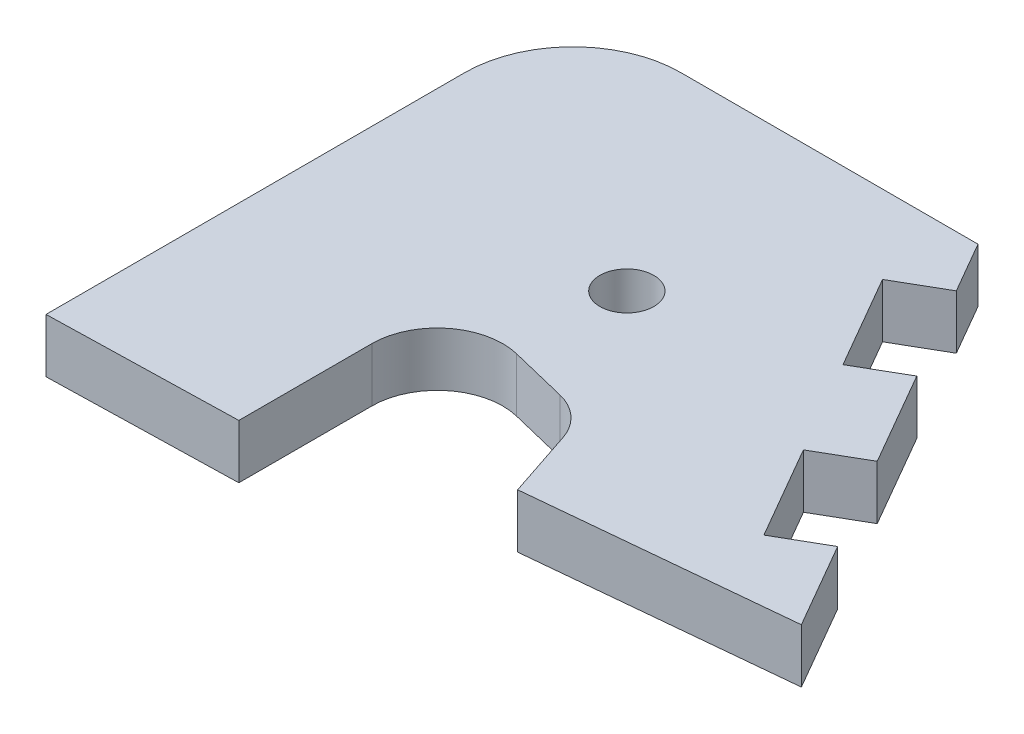
ISO-10303-21;
HEADER;
FILE_DESCRIPTION(('STEP AP214'),'2;1');
FILE_NAME('part.step','',(''),(''),'','','');
FILE_SCHEMA(('AUTOMOTIVE_DESIGN { 1 0 10303 214 1 1 1 1 }'));
ENDSEC;
DATA;
#1=APPLICATION_CONTEXT('core data for automotive mechanical design processes');
#2=APPLICATION_PROTOCOL_DEFINITION('international standard','automotive_design',2000,#1);
#3=PRODUCT_CONTEXT('',#1,'mechanical');
#4=PRODUCT('Part','Part','',(#3));
#5=PRODUCT_RELATED_PRODUCT_CATEGORY('part','',(#4));
#6=PRODUCT_DEFINITION_FORMATION('','',#4);
#7=PRODUCT_DEFINITION_CONTEXT('part definition',#1,'design');
#8=PRODUCT_DEFINITION('design','',#6,#7);
#9=PRODUCT_DEFINITION_SHAPE('','',#8);
#10=(LENGTH_UNIT() NAMED_UNIT(*) SI_UNIT(.MILLI.,.METRE.));
#11=(NAMED_UNIT(*) PLANE_ANGLE_UNIT() SI_UNIT($,.RADIAN.));
#12=(NAMED_UNIT(*) SI_UNIT($,.STERADIAN.) SOLID_ANGLE_UNIT());
#13=UNCERTAINTY_MEASURE_WITH_UNIT(LENGTH_MEASURE(1.E-05),#10,'distance_accuracy_value','');
#14=(GEOMETRIC_REPRESENTATION_CONTEXT(3) GLOBAL_UNCERTAINTY_ASSIGNED_CONTEXT((#13)) GLOBAL_UNIT_ASSIGNED_CONTEXT((#10,
#11,#12)) REPRESENTATION_CONTEXT('',''));
#15=CARTESIAN_POINT('',(0.,0.,0.));
#16=DIRECTION('',(0.,0.,1.));
#17=DIRECTION('',(1.,0.,0.));
#18=AXIS2_PLACEMENT_3D('',#15,#16,#17);
#19=CARTESIAN_POINT('',(8.10437226417191,10.,32.5780480350778));
#20=DIRECTION('',(0.,-1.,0.));
#21=DIRECTION('',(0.,0.,-1.));
#22=AXIS2_PLACEMENT_3D('',#19,#20,#21);
#23=PLANE('',#22);
#24=DIRECTION('',(-0.499999999999998,0.,-0.86602540378444));
#25=VECTOR('',#24,1.);
#26=CARTESIAN_POINT('',(25.,10.,-40.));
#27=LINE('',#26,#25);
#28=CARTESIAN_POINT('',(30.4788257655355,10.,-30.510395408275));
#29=VERTEX_POINT('',#28);
#30=CARTESIAN_POINT('',(25.,10.,-40.));
#31=VERTEX_POINT('',#30);
#32=EDGE_CURVE('E206',#29,#31,#27,.T.);
#33=ORIENTED_EDGE('',*,*,#32,.T.);
#34=DIRECTION('',(1.,0.,0.));
#35=VECTOR('',#34,1.);
#36=CARTESIAN_POINT('',(-50.,10.,-40.));
#37=LINE('',#36,#35);
#38=CARTESIAN_POINT('',(-30.,10.,-40.));
#39=VERTEX_POINT('',#38);
#40=EDGE_CURVE('E86',#31,#39,#37,.F.);
#41=ORIENTED_EDGE('',*,*,#40,.T.);
#42=CARTESIAN_POINT('',(-30.,10.,-20.));
#43=DIRECTION('',(0.,-1.,0.));
#44=DIRECTION('',(0.,0.,-1.));
#45=AXIS2_PLACEMENT_3D('',#42,#43,#44);
#46=CIRCLE('',#45,20.);
#47=CARTESIAN_POINT('',(-50.,10.,-20.));
#48=VERTEX_POINT('',#47);
#49=EDGE_CURVE('E78',#48,#39,#46,.T.);
#50=ORIENTED_EDGE('',*,*,#49,.F.);
#51=DIRECTION('',(0.,0.,-1.));
#52=VECTOR('',#51,1.);
#53=CARTESIAN_POINT('',(-50.,10.,13.));
#54=LINE('',#53,#52);
#55=CARTESIAN_POINT('',(-50.,10.,57.5173994804494));
#56=VERTEX_POINT('',#55);
#57=EDGE_CURVE('E146',#48,#56,#54,.F.);
#58=ORIENTED_EDGE('',*,*,#57,.T.);
#59=DIRECTION('',(0.999701273568704,0.,-0.0244410234055541));
#60=VECTOR('',#59,1.);
#61=CARTESIAN_POINT('',(-15.1570472119715,10.,56.6655475851619));
#62=LINE('',#61,#60);
#63=CARTESIAN_POINT('',(-15.1570472119715,10.,56.6655475851619));
#64=VERTEX_POINT('',#63);
#65=EDGE_CURVE('E237',#56,#64,#62,.T.);
#66=ORIENTED_EDGE('',*,*,#65,.T.);
#67=DIRECTION('',(0.,0.,-1.));
#68=VECTOR('',#67,1.);
#69=CARTESIAN_POINT('',(-15.1570472119715,10.,32.0421540849214));
#70=LINE('',#69,#68);
#71=CARTESIAN_POINT('',(-15.1570472119715,10.,32.0421540849214));
#72=VERTEX_POINT('',#71);
#73=EDGE_CURVE('E334',#64,#72,#70,.T.);
#74=ORIENTED_EDGE('',*,*,#73,.T.);
#75=CARTESIAN_POINT('',(-3.03936223927807,10.,32.0421540849214));
#76=DIRECTION('',(0.,-1.,0.));
#77=DIRECTION('',(0.,0.,1.));
#78=AXIS2_PLACEMENT_3D('',#75,#76,#77);
#79=CIRCLE('',#78,12.1176849726935);
#80=CARTESIAN_POINT('',(-0.17043084930761,10.,20.2689845126659));
#81=VERTEX_POINT('',#80);
#82=EDGE_CURVE('E336',#72,#81,#79,.T.);
#83=ORIENTED_EDGE('',*,*,#82,.T.);
#84=DIRECTION('',(-0.971569206394266,0.,-0.236755733164829));
#85=VECTOR('',#84,1.);
#86=CARTESIAN_POINT('',(-29.9999999999998,10.,13.));
#87=LINE('',#86,#85);
#88=CARTESIAN_POINT('',(10.4719295958201,10.,22.8623559711353));
#89=VERTEX_POINT('',#88);
#90=EDGE_CURVE('E38',#81,#89,#87,.F.);
#91=ORIENTED_EDGE('',*,*,#90,.T.);
#92=CARTESIAN_POINT('',(8.10437226417191,10.,32.5780480350778));
#93=DIRECTION('',(0.,-1.,0.));
#94=DIRECTION('',(0.,0.,-1.));
#95=AXIS2_PLACEMENT_3D('',#92,#93,#94);
#96=CIRCLE('',#95,9.99999999999988);
#97=CARTESIAN_POINT('',(17.5939768558969,10.,29.4240973866512));
#98=VERTEX_POINT('',#97);
#99=EDGE_CURVE('E297',#89,#98,#96,.T.);
#100=ORIENTED_EDGE('',*,*,#99,.T.);
#101=DIRECTION('',(-0.315395064842665,0.,-0.948960459172505));
#102=VECTOR('',#101,1.);
#103=CARTESIAN_POINT('',(17.5939768558969,10.,29.4240973866513));
#104=LINE('',#103,#102);
#105=CARTESIAN_POINT('',(21.7669081574552,10.,41.9796102828265));
#106=VERTEX_POINT('',#105);
#107=EDGE_CURVE('E300',#98,#106,#104,.F.);
#108=ORIENTED_EDGE('',*,*,#107,.T.);
#109=DIRECTION('',(0.995364514557602,0.,-0.0961742333450592));
#110=VECTOR('',#109,1.);
#111=CARTESIAN_POINT('',(21.7669081574552,10.,41.9796102828265));
#112=LINE('',#111,#110);
#113=CARTESIAN_POINT('',(69.6592830691413,10.,37.3521473053536));
#114=VERTEX_POINT('',#113);
#115=EDGE_CURVE('E340',#106,#114,#112,.T.);
#116=ORIENTED_EDGE('',*,*,#115,.T.);
#117=DIRECTION('',(-0.499999999999998,0.,-0.86602540378444));
#118=VECTOR('',#117,1.);
#119=CARTESIAN_POINT('',(60.4788257655354,10.,21.4511288187914));
#120=LINE('',#119,#118);
#121=CARTESIAN_POINT('',(60.4788257655354,10.,21.4511288187914));
#122=VERTEX_POINT('',#121);
#123=EDGE_CURVE('E342',#114,#122,#120,.T.);
#124=ORIENTED_EDGE('',*,*,#123,.T.);
#125=DIRECTION('',(-0.866025403784439,0.,0.499999999999999));
#126=VECTOR('',#125,1.);
#127=CARTESIAN_POINT('',(60.4788257655354,10.,21.4511288187914));
#128=LINE('',#127,#126);
#129=CARTESIAN_POINT('',(51.8185717276911,10.,26.4511288187914));
#130=VERTEX_POINT('',#129);
#131=EDGE_CURVE('E344',#122,#130,#128,.T.);
#132=ORIENTED_EDGE('',*,*,#131,.T.);
#133=DIRECTION('',(-0.499999999999999,0.,-0.866025403784439));
#134=VECTOR('',#133,1.);
#135=CARTESIAN_POINT('',(41.8185717276911,10.,9.13062074310259));
#136=LINE('',#135,#134);
#137=CARTESIAN_POINT('',(41.8185717276911,10.,9.13062074310259));
#138=VERTEX_POINT('',#137);
#139=EDGE_CURVE('E346',#130,#138,#136,.T.);
#140=ORIENTED_EDGE('',*,*,#139,.T.);
#141=DIRECTION('',(0.866025403784439,0.,-0.499999999999999));
#142=VECTOR('',#141,1.);
#143=CARTESIAN_POINT('',(50.4788257655355,10.,4.13062074310261));
#144=LINE('',#143,#142);
#145=CARTESIAN_POINT('',(50.4788257655355,10.,4.13062074310261));
#146=VERTEX_POINT('',#145);
#147=EDGE_CURVE('E348',#138,#146,#144,.T.);
#148=ORIENTED_EDGE('',*,*,#147,.T.);
#149=DIRECTION('',(-0.499999999999998,0.,-0.86602540378444));
#150=VECTOR('',#149,1.);
#151=CARTESIAN_POINT('',(40.4788257655355,10.,-13.1898873325862));
#152=LINE('',#151,#150);
#153=CARTESIAN_POINT('',(40.4788257655355,10.,-13.1898873325862));
#154=VERTEX_POINT('',#153);
#155=EDGE_CURVE('E350',#146,#154,#152,.T.);
#156=ORIENTED_EDGE('',*,*,#155,.T.);
#157=DIRECTION('',(-0.866025403784439,0.,0.499999999999999));
#158=VECTOR('',#157,1.);
#159=CARTESIAN_POINT('',(40.4788257655355,10.,-13.1898873325862));
#160=LINE('',#159,#158);
#161=CARTESIAN_POINT('',(31.8185717276911,10.,-8.1898873325862));
#162=VERTEX_POINT('',#161);
#163=EDGE_CURVE('E188',#154,#162,#160,.T.);
#164=ORIENTED_EDGE('',*,*,#163,.T.);
#165=DIRECTION('',(-0.499999999999998,0.,-0.86602540378444));
#166=VECTOR('',#165,1.);
#167=CARTESIAN_POINT('',(21.8185717276911,10.,-25.510395408275));
#168=LINE('',#167,#166);
#169=CARTESIAN_POINT('',(21.8185717276911,10.,-25.510395408275));
#170=VERTEX_POINT('',#169);
#171=EDGE_CURVE('E181',#162,#170,#168,.T.);
#172=ORIENTED_EDGE('',*,*,#171,.T.);
#173=DIRECTION('',(0.86602540378444,0.,-0.499999999999998));
#174=VECTOR('',#173,1.);
#175=CARTESIAN_POINT('',(30.4788257655355,10.,-30.510395408275));
#176=LINE('',#175,#174);
#177=EDGE_CURVE('E185',#170,#29,#176,.T.);
#178=ORIENTED_EDGE('',*,*,#177,.T.);
#179=EDGE_LOOP('',(#33,#41,#50,#58,#66,#74,#83,#91,#100,#108,#116,#124,#132,#140,#148,#156,#164,
#172,#178));
#180=FACE_BOUND('',#179,.T.);
#181=CARTESIAN_POINT('',(0.,10.,0.));
#182=DIRECTION('',(0.,-1.,0.));
#183=DIRECTION('',(0.,0.,-1.));
#184=AXIS2_PLACEMENT_3D('',#181,#182,#183);
#185=CIRCLE('',#184,5.);
#186=CARTESIAN_POINT('',(0.,10.,-5.));
#187=VERTEX_POINT('',#186);
#188=EDGE_CURVE('E291',#187,#187,#185,.T.);
#189=ORIENTED_EDGE('',*,*,#188,.T.);
#190=EDGE_LOOP('',(#189));
#191=FACE_BOUND('',#190,.T.);
#192=ADVANCED_FACE('F35',(#180,#191),#23,.F.);
#193=CARTESIAN_POINT('',(-50.,10.,13.));
#194=DIRECTION('',(1.,0.,0.));
#195=DIRECTION('',(0.,0.,-1.));
#196=AXIS2_PLACEMENT_3D('',#193,#194,#195);
#197=PLANE('',#196);
#198=DIRECTION('',(0.,-1.,0.));
#199=VECTOR('',#198,1.);
#200=CARTESIAN_POINT('',(-50.,10.,-20.));
#201=LINE('',#200,#199);
#202=CARTESIAN_POINT('',(-50.,0.,-20.));
#203=VERTEX_POINT('',#202);
#204=EDGE_CURVE('E301',#203,#48,#201,.F.);
#205=ORIENTED_EDGE('',*,*,#204,.F.);
#206=DIRECTION('',(0.,0.,-1.));
#207=VECTOR('',#206,1.);
#208=CARTESIAN_POINT('',(-50.,0.,32.5780480350778));
#209=LINE('',#208,#207);
#210=CARTESIAN_POINT('',(-50.,0.,57.5173994804494));
#211=VERTEX_POINT('',#210);
#212=EDGE_CURVE('E288',#211,#203,#209,.T.);
#213=ORIENTED_EDGE('',*,*,#212,.F.);
#214=DIRECTION('',(0.,-1.,0.));
#215=VECTOR('',#214,1.);
#216=CARTESIAN_POINT('',(-50.,10.,57.5173994804494));
#217=LINE('',#216,#215);
#218=EDGE_CURVE('E271',#56,#211,#217,.T.);
#219=ORIENTED_EDGE('',*,*,#218,.F.);
#220=ORIENTED_EDGE('',*,*,#57,.F.);
#221=EDGE_LOOP('',(#205,#213,#219,#220));
#222=FACE_BOUND('',#221,.T.);
#223=ADVANCED_FACE('F328',(#222),#197,.F.);
#224=CARTESIAN_POINT('',(-30.,10.,-20.));
#225=DIRECTION('',(0.,-1.,0.));
#226=DIRECTION('',(0.,0.,-1.));
#227=AXIS2_PLACEMENT_3D('',#224,#225,#226);
#228=CYLINDRICAL_SURFACE('',#227,20.);
#229=CARTESIAN_POINT('',(-30.,0.,-20.));
#230=DIRECTION('',(0.,-1.,0.));
#231=DIRECTION('',(0.,0.,-1.));
#232=AXIS2_PLACEMENT_3D('',#229,#230,#231);
#233=CIRCLE('',#232,20.);
#234=CARTESIAN_POINT('',(-30.,0.,-40.));
#235=VERTEX_POINT('',#234);
#236=EDGE_CURVE('E285',#203,#235,#233,.T.);
#237=ORIENTED_EDGE('',*,*,#236,.F.);
#238=ORIENTED_EDGE('',*,*,#204,.T.);
#239=ORIENTED_EDGE('',*,*,#49,.T.);
#240=DIRECTION('',(0.,1.,0.));
#241=VECTOR('',#240,1.);
#242=CARTESIAN_POINT('',(-30.,10.,-40.));
#243=LINE('',#242,#241);
#244=EDGE_CURVE('E298',#39,#235,#243,.F.);
#245=ORIENTED_EDGE('',*,*,#244,.T.);
#246=EDGE_LOOP('',(#237,#238,#239,#245));
#247=FACE_BOUND('',#246,.T.);
#248=ADVANCED_FACE('F321',(#247),#228,.T.);
#249=CARTESIAN_POINT('',(-50.,10.,-40.));
#250=DIRECTION('',(0.,0.,1.));
#251=DIRECTION('',(1.,0.,0.));
#252=AXIS2_PLACEMENT_3D('',#249,#250,#251);
#253=PLANE('',#252);
#254=ORIENTED_EDGE('',*,*,#244,.F.);
#255=ORIENTED_EDGE('',*,*,#40,.F.);
#256=DIRECTION('',(0.,-1.,0.));
#257=VECTOR('',#256,1.);
#258=CARTESIAN_POINT('',(25.,10.,-40.));
#259=LINE('',#258,#257);
#260=CARTESIAN_POINT('',(25.,0.,-40.));
#261=VERTEX_POINT('',#260);
#262=EDGE_CURVE('E208',#31,#261,#259,.T.);
#263=ORIENTED_EDGE('',*,*,#262,.T.);
#264=DIRECTION('',(1.,0.,0.));
#265=VECTOR('',#264,1.);
#266=CARTESIAN_POINT('',(8.10437226417191,0.,-40.));
#267=LINE('',#266,#265);
#268=EDGE_CURVE('E141',#235,#261,#267,.T.);
#269=ORIENTED_EDGE('',*,*,#268,.F.);
#270=EDGE_LOOP('',(#254,#255,#263,#269));
#271=FACE_BOUND('',#270,.T.);
#272=ADVANCED_FACE('F322',(#271),#253,.F.);
#273=CARTESIAN_POINT('',(17.5939768558969,10.,29.4240973866513));
#274=DIRECTION('',(0.948960459172505,0.,-0.315395064842665));
#275=DIRECTION('',(-0.315395064842665,0.,-0.948960459172505));
#276=AXIS2_PLACEMENT_3D('',#273,#274,#275);
#277=PLANE('',#276);
#278=DIRECTION('',(-0.315395064842665,0.,-0.948960459172504));
#279=VECTOR('',#278,1.);
#280=CARTESIAN_POINT('',(19.6449779262188,0.,35.5951480288893));
#281=LINE('',#280,#279);
#282=CARTESIAN_POINT('',(21.7669081574552,0.,41.9796102828265));
#283=VERTEX_POINT('',#282);
#284=CARTESIAN_POINT('',(17.5939768558969,0.,29.4240973866512));
#285=VERTEX_POINT('',#284);
#286=EDGE_CURVE('E279',#283,#285,#281,.T.);
#287=ORIENTED_EDGE('',*,*,#286,.F.);
#288=DIRECTION('',(0.,-1.,0.));
#289=VECTOR('',#288,1.);
#290=CARTESIAN_POINT('',(21.7669081574552,10.,41.9796102828265));
#291=LINE('',#290,#289);
#292=EDGE_CURVE('E259',#106,#283,#291,.T.);
#293=ORIENTED_EDGE('',*,*,#292,.F.);
#294=ORIENTED_EDGE('',*,*,#107,.F.);
#295=DIRECTION('',(0.,-1.,0.));
#296=VECTOR('',#295,1.);
#297=CARTESIAN_POINT('',(17.5939768558969,10.,29.4240973866513));
#298=LINE('',#297,#296);
#299=EDGE_CURVE('E295',#98,#285,#298,.T.);
#300=ORIENTED_EDGE('',*,*,#299,.T.);
#301=EDGE_LOOP('',(#287,#293,#294,#300));
#302=FACE_BOUND('',#301,.T.);
#303=ADVANCED_FACE('F391',(#302),#277,.F.);
#304=CARTESIAN_POINT('',(8.10437226417191,10.,32.5780480350778));
#305=DIRECTION('',(0.,-1.,0.));
#306=DIRECTION('',(0.,0.,-1.));
#307=AXIS2_PLACEMENT_3D('',#304,#305,#306);
#308=CYLINDRICAL_SURFACE('',#307,9.99999999999988);
#309=ORIENTED_EDGE('',*,*,#299,.F.);
#310=ORIENTED_EDGE('',*,*,#99,.F.);
#311=DIRECTION('',(0.,1.,0.));
#312=VECTOR('',#311,1.);
#313=CARTESIAN_POINT('',(10.4719295958201,10.,22.8623559711353));
#314=LINE('',#313,#312);
#315=CARTESIAN_POINT('',(10.4719295958201,0.,22.8623559711353));
#316=VERTEX_POINT('',#315);
#317=EDGE_CURVE('E54',#89,#316,#314,.F.);
#318=ORIENTED_EDGE('',*,*,#317,.T.);
#319=CARTESIAN_POINT('',(8.10437226417191,0.,32.5780480350778));
#320=DIRECTION('',(0.,-1.,0.));
#321=DIRECTION('',(0.,0.,-1.));
#322=AXIS2_PLACEMENT_3D('',#319,#320,#321);
#323=CIRCLE('',#322,9.99999999999988);
#324=EDGE_CURVE('E276',#285,#316,#323,.F.);
#325=ORIENTED_EDGE('',*,*,#324,.F.);
#326=EDGE_LOOP('',(#309,#310,#318,#325));
#327=FACE_BOUND('',#326,.T.);
#328=ADVANCED_FACE('F387',(#327),#308,.F.);
#329=CARTESIAN_POINT('',(-29.9999999999998,10.,13.));
#330=DIRECTION('',(0.236755733164829,0.,-0.971569206394266));
#331=DIRECTION('',(-0.971569206394266,0.,-0.236755733164829));
#332=AXIS2_PLACEMENT_3D('',#329,#330,#331);
#333=PLANE('',#332);
#334=ORIENTED_EDGE('',*,*,#90,.F.);
#335=DIRECTION('',(0.,-1.,0.));
#336=VECTOR('',#335,1.);
#337=CARTESIAN_POINT('',(-0.17043084930761,10.,20.2689845126659));
#338=LINE('',#337,#336);
#339=CARTESIAN_POINT('',(-0.17043084930761,0.,20.2689845126659));
#340=VERTEX_POINT('',#339);
#341=EDGE_CURVE('E262',#81,#340,#338,.T.);
#342=ORIENTED_EDGE('',*,*,#341,.T.);
#343=DIRECTION('',(-0.971569206394266,0.,-0.236755733164828));
#344=VECTOR('',#343,1.);
#345=CARTESIAN_POINT('',(10.4719295958201,0.,22.8623559711352));
#346=LINE('',#345,#344);
#347=EDGE_CURVE('E45',#316,#340,#346,.T.);
#348=ORIENTED_EDGE('',*,*,#347,.F.);
#349=ORIENTED_EDGE('',*,*,#317,.F.);
#350=EDGE_LOOP('',(#334,#342,#348,#349));
#351=FACE_BOUND('',#350,.T.);
#352=ADVANCED_FACE('F380',(#351),#333,.F.);
#353=CARTESIAN_POINT('',(0.,10.,0.));
#354=DIRECTION('',(0.,-1.,0.));
#355=DIRECTION('',(0.,0.,-1.));
#356=AXIS2_PLACEMENT_3D('',#353,#354,#355);
#357=CYLINDRICAL_SURFACE('',#356,5.);
#358=ORIENTED_EDGE('',*,*,#188,.F.);
#359=EDGE_LOOP('',(#358));
#360=FACE_BOUND('',#359,.T.);
#361=CARTESIAN_POINT('',(0.,0.,0.));
#362=DIRECTION('',(0.,-1.,0.));
#363=DIRECTION('',(0.,0.,-1.));
#364=AXIS2_PLACEMENT_3D('',#361,#362,#363);
#365=CIRCLE('',#364,5.);
#366=CARTESIAN_POINT('',(0.,0.,-5.));
#367=VERTEX_POINT('',#366);
#368=EDGE_CURVE('E11',#367,#367,#365,.F.);
#369=ORIENTED_EDGE('',*,*,#368,.F.);
#370=EDGE_LOOP('',(#369));
#371=FACE_BOUND('',#370,.T.);
#372=ADVANCED_FACE('F371',(#360,#371),#357,.F.);
#373=CARTESIAN_POINT('',(8.10437226417191,0.,32.5780480350778));
#374=DIRECTION('',(0.,-1.,0.));
#375=DIRECTION('',(0.,0.,-1.));
#376=AXIS2_PLACEMENT_3D('',#373,#374,#375);
#377=PLANE('',#376);
#378=ORIENTED_EDGE('',*,*,#368,.T.);
#379=EDGE_LOOP('',(#378));
#380=FACE_BOUND('',#379,.T.);
#381=ORIENTED_EDGE('',*,*,#347,.T.);
#382=CARTESIAN_POINT('',(-3.03936223927807,0.,32.0421540849214));
#383=DIRECTION('',(0.,-1.,0.));
#384=DIRECTION('',(0.,0.,1.));
#385=AXIS2_PLACEMENT_3D('',#382,#383,#384);
#386=CIRCLE('',#385,12.1176849726935);
#387=CARTESIAN_POINT('',(-15.1570472119715,0.,32.0421540849214));
#388=VERTEX_POINT('',#387);
#389=EDGE_CURVE('E216',#388,#340,#386,.T.);
#390=ORIENTED_EDGE('',*,*,#389,.F.);
#391=DIRECTION('',(0.,0.,-1.));
#392=VECTOR('',#391,1.);
#393=CARTESIAN_POINT('',(-15.1570472119715,0.,32.0421540849214));
#394=LINE('',#393,#392);
#395=CARTESIAN_POINT('',(-15.1570472119715,0.,56.6655475851619));
#396=VERTEX_POINT('',#395);
#397=EDGE_CURVE('E214',#396,#388,#394,.T.);
#398=ORIENTED_EDGE('',*,*,#397,.F.);
#399=DIRECTION('',(0.999701273568704,0.,-0.0244410234055541));
#400=VECTOR('',#399,1.);
#401=CARTESIAN_POINT('',(-15.1570472119715,0.,56.6655475851619));
#402=LINE('',#401,#400);
#403=EDGE_CURVE('E212',#211,#396,#402,.T.);
#404=ORIENTED_EDGE('',*,*,#403,.F.);
#405=ORIENTED_EDGE('',*,*,#212,.T.);
#406=ORIENTED_EDGE('',*,*,#236,.T.);
#407=ORIENTED_EDGE('',*,*,#268,.T.);
#408=DIRECTION('',(-0.499999999999998,0.,-0.86602540378444));
#409=VECTOR('',#408,1.);
#410=CARTESIAN_POINT('',(25.,0.,-40.));
#411=LINE('',#410,#409);
#412=CARTESIAN_POINT('',(30.4788257655355,0.,-30.510395408275));
#413=VERTEX_POINT('',#412);
#414=EDGE_CURVE('E235',#413,#261,#411,.T.);
#415=ORIENTED_EDGE('',*,*,#414,.F.);
#416=DIRECTION('',(0.86602540378444,0.,-0.499999999999998));
#417=VECTOR('',#416,1.);
#418=CARTESIAN_POINT('',(30.4788257655355,0.,-30.510395408275));
#419=LINE('',#418,#417);
#420=CARTESIAN_POINT('',(21.8185717276911,0.,-25.510395408275));
#421=VERTEX_POINT('',#420);
#422=EDGE_CURVE('E233',#421,#413,#419,.T.);
#423=ORIENTED_EDGE('',*,*,#422,.F.);
#424=DIRECTION('',(-0.499999999999998,0.,-0.86602540378444));
#425=VECTOR('',#424,1.);
#426=CARTESIAN_POINT('',(21.8185717276911,0.,-25.510395408275));
#427=LINE('',#426,#425);
#428=CARTESIAN_POINT('',(31.8185717276911,0.,-8.1898873325862));
#429=VERTEX_POINT('',#428);
#430=EDGE_CURVE('E197',#429,#421,#427,.T.);
#431=ORIENTED_EDGE('',*,*,#430,.F.);
#432=DIRECTION('',(-0.866025403784439,0.,0.499999999999999));
#433=VECTOR('',#432,1.);
#434=CARTESIAN_POINT('',(40.4788257655355,0.,-13.1898873325862));
#435=LINE('',#434,#433);
#436=CARTESIAN_POINT('',(40.4788257655355,0.,-13.1898873325862));
#437=VERTEX_POINT('',#436);
#438=EDGE_CURVE('E230',#437,#429,#435,.T.);
#439=ORIENTED_EDGE('',*,*,#438,.F.);
#440=DIRECTION('',(-0.499999999999998,0.,-0.86602540378444));
#441=VECTOR('',#440,1.);
#442=CARTESIAN_POINT('',(40.4788257655355,0.,-13.1898873325862));
#443=LINE('',#442,#441);
#444=CARTESIAN_POINT('',(50.4788257655355,0.,4.13062074310261));
#445=VERTEX_POINT('',#444);
#446=EDGE_CURVE('E228',#445,#437,#443,.T.);
#447=ORIENTED_EDGE('',*,*,#446,.F.);
#448=DIRECTION('',(0.866025403784439,0.,-0.499999999999999));
#449=VECTOR('',#448,1.);
#450=CARTESIAN_POINT('',(50.4788257655355,0.,4.13062074310261));
#451=LINE('',#450,#449);
#452=CARTESIAN_POINT('',(41.8185717276911,0.,9.13062074310259));
#453=VERTEX_POINT('',#452);
#454=EDGE_CURVE('E226',#453,#445,#451,.T.);
#455=ORIENTED_EDGE('',*,*,#454,.F.);
#456=DIRECTION('',(-0.499999999999999,0.,-0.866025403784439));
#457=VECTOR('',#456,1.);
#458=CARTESIAN_POINT('',(41.8185717276911,0.,9.13062074310259));
#459=LINE('',#458,#457);
#460=CARTESIAN_POINT('',(51.8185717276911,0.,26.4511288187914));
#461=VERTEX_POINT('',#460);
#462=EDGE_CURVE('E224',#461,#453,#459,.T.);
#463=ORIENTED_EDGE('',*,*,#462,.F.);
#464=DIRECTION('',(-0.866025403784439,0.,0.499999999999999));
#465=VECTOR('',#464,1.);
#466=CARTESIAN_POINT('',(60.4788257655354,0.,21.4511288187914));
#467=LINE('',#466,#465);
#468=CARTESIAN_POINT('',(60.4788257655354,0.,21.4511288187914));
#469=VERTEX_POINT('',#468);
#470=EDGE_CURVE('E222',#469,#461,#467,.T.);
#471=ORIENTED_EDGE('',*,*,#470,.F.);
#472=DIRECTION('',(-0.499999999999998,0.,-0.86602540378444));
#473=VECTOR('',#472,1.);
#474=CARTESIAN_POINT('',(60.4788257655354,0.,21.4511288187914));
#475=LINE('',#474,#473);
#476=CARTESIAN_POINT('',(69.6592830691413,0.,37.3521473053536));
#477=VERTEX_POINT('',#476);
#478=EDGE_CURVE('E220',#477,#469,#475,.T.);
#479=ORIENTED_EDGE('',*,*,#478,.F.);
#480=DIRECTION('',(0.995364514557602,0.,-0.0961742333450592));
#481=VECTOR('',#480,1.);
#482=CARTESIAN_POINT('',(21.7669081574552,0.,41.9796102828265));
#483=LINE('',#482,#481);
#484=EDGE_CURVE('E218',#283,#477,#483,.T.);
#485=ORIENTED_EDGE('',*,*,#484,.F.);
#486=ORIENTED_EDGE('',*,*,#286,.T.);
#487=ORIENTED_EDGE('',*,*,#324,.T.);
#488=EDGE_LOOP('',(#381,#390,#398,#404,#405,#406,#407,#415,#423,#431,#439,#447,#455,#463,#471,
#479,#485,#486,#487));
#489=FACE_BOUND('',#488,.T.);
#490=ADVANCED_FACE('F324',(#380,#489),#377,.T.);
#491=CARTESIAN_POINT('',(-15.1570472119715,10.,32.0421540849214));
#492=DIRECTION('',(-1.,0.,0.));
#493=DIRECTION('',(0.,0.,1.));
#494=AXIS2_PLACEMENT_3D('',#491,#492,#493);
#495=PLANE('',#494);
#496=ORIENTED_EDGE('',*,*,#397,.T.);
#497=DIRECTION('',(0.,-1.,0.));
#498=VECTOR('',#497,1.);
#499=CARTESIAN_POINT('',(-15.1570472119715,10.,32.0421540849214));
#500=LINE('',#499,#498);
#501=EDGE_CURVE('E265',#72,#388,#500,.T.);
#502=ORIENTED_EDGE('',*,*,#501,.F.);
#503=ORIENTED_EDGE('',*,*,#73,.F.);
#504=DIRECTION('',(0.,-1.,0.));
#505=VECTOR('',#504,1.);
#506=CARTESIAN_POINT('',(-15.1570472119715,10.,56.6655475851619));
#507=LINE('',#506,#505);
#508=EDGE_CURVE('E268',#64,#396,#507,.T.);
#509=ORIENTED_EDGE('',*,*,#508,.T.);
#510=EDGE_LOOP('',(#496,#502,#503,#509));
#511=FACE_BOUND('',#510,.T.);
#512=ADVANCED_FACE('F370',(#511),#495,.F.);
#513=CARTESIAN_POINT('',(-15.1570472119715,10.,56.6655475851619));
#514=DIRECTION('',(-0.0244410234055541,0.,-0.999701273568704));
#515=DIRECTION('',(-0.999701273568704,0.,0.0244410234055541));
#516=AXIS2_PLACEMENT_3D('',#513,#514,#515);
#517=PLANE('',#516);
#518=ORIENTED_EDGE('',*,*,#403,.T.);
#519=ORIENTED_EDGE('',*,*,#508,.F.);
#520=ORIENTED_EDGE('',*,*,#65,.F.);
#521=ORIENTED_EDGE('',*,*,#218,.T.);
#522=EDGE_LOOP('',(#518,#519,#520,#521));
#523=FACE_BOUND('',#522,.T.);
#524=ADVANCED_FACE('F331',(#523),#517,.F.);
#525=CARTESIAN_POINT('',(-3.03936223927807,10.,32.0421540849214));
#526=DIRECTION('',(0.,-1.,0.));
#527=DIRECTION('',(0.,0.,-1.));
#528=AXIS2_PLACEMENT_3D('',#525,#526,#527);
#529=CYLINDRICAL_SURFACE('',#528,12.1176849726935);
#530=ORIENTED_EDGE('',*,*,#389,.T.);
#531=ORIENTED_EDGE('',*,*,#341,.F.);
#532=ORIENTED_EDGE('',*,*,#82,.F.);
#533=ORIENTED_EDGE('',*,*,#501,.T.);
#534=EDGE_LOOP('',(#530,#531,#532,#533));
#535=FACE_BOUND('',#534,.T.);
#536=ADVANCED_FACE('F458',(#535),#529,.F.);
#537=CARTESIAN_POINT('',(21.7669081574552,10.,41.9796102828265));
#538=DIRECTION('',(-0.0961742333450592,0.,-0.995364514557602));
#539=DIRECTION('',(-0.995364514557602,0.,0.0961742333450592));
#540=AXIS2_PLACEMENT_3D('',#537,#538,#539);
#541=PLANE('',#540);
#542=ORIENTED_EDGE('',*,*,#484,.T.);
#543=DIRECTION('',(0.,-1.,0.));
#544=VECTOR('',#543,1.);
#545=CARTESIAN_POINT('',(69.6592830691413,10.,37.3521473053536));
#546=LINE('',#545,#544);
#547=EDGE_CURVE('E256',#114,#477,#546,.T.);
#548=ORIENTED_EDGE('',*,*,#547,.F.);
#549=ORIENTED_EDGE('',*,*,#115,.F.);
#550=ORIENTED_EDGE('',*,*,#292,.T.);
#551=EDGE_LOOP('',(#542,#548,#549,#550));
#552=FACE_BOUND('',#551,.T.);
#553=ADVANCED_FACE('F466',(#552),#541,.F.);
#554=CARTESIAN_POINT('',(60.4788257655354,10.,21.4511288187914));
#555=DIRECTION('',(-0.86602540378444,0.,0.499999999999998));
#556=DIRECTION('',(0.499999999999998,0.,0.86602540378444));
#557=AXIS2_PLACEMENT_3D('',#554,#555,#556);
#558=PLANE('',#557);
#559=ORIENTED_EDGE('',*,*,#478,.T.);
#560=DIRECTION('',(0.,-1.,0.));
#561=VECTOR('',#560,1.);
#562=CARTESIAN_POINT('',(60.4788257655354,10.,21.4511288187914));
#563=LINE('',#562,#561);
#564=EDGE_CURVE('E253',#122,#469,#563,.T.);
#565=ORIENTED_EDGE('',*,*,#564,.F.);
#566=ORIENTED_EDGE('',*,*,#123,.F.);
#567=ORIENTED_EDGE('',*,*,#547,.T.);
#568=EDGE_LOOP('',(#559,#565,#566,#567));
#569=FACE_BOUND('',#568,.T.);
#570=ADVANCED_FACE('F476',(#569),#558,.F.);
#571=CARTESIAN_POINT('',(60.4788257655354,10.,21.4511288187914));
#572=DIRECTION('',(0.499999999999999,0.,0.866025403784439));
#573=DIRECTION('',(0.866025403784439,0.,-0.499999999999999));
#574=AXIS2_PLACEMENT_3D('',#571,#572,#573);
#575=PLANE('',#574);
#576=ORIENTED_EDGE('',*,*,#470,.T.);
#577=DIRECTION('',(0.,-1.,0.));
#578=VECTOR('',#577,1.);
#579=CARTESIAN_POINT('',(51.8185717276911,10.,26.4511288187914));
#580=LINE('',#579,#578);
#581=EDGE_CURVE('E250',#130,#461,#580,.T.);
#582=ORIENTED_EDGE('',*,*,#581,.F.);
#583=ORIENTED_EDGE('',*,*,#131,.F.);
#584=ORIENTED_EDGE('',*,*,#564,.T.);
#585=EDGE_LOOP('',(#576,#582,#583,#584));
#586=FACE_BOUND('',#585,.T.);
#587=ADVANCED_FACE('F486',(#586),#575,.F.);
#588=CARTESIAN_POINT('',(41.8185717276911,10.,9.13062074310259));
#589=DIRECTION('',(-0.866025403784439,0.,0.499999999999999));
#590=DIRECTION('',(0.499999999999999,0.,0.866025403784439));
#591=AXIS2_PLACEMENT_3D('',#588,#589,#590);
#592=PLANE('',#591);
#593=ORIENTED_EDGE('',*,*,#462,.T.);
#594=DIRECTION('',(0.,-1.,0.));
#595=VECTOR('',#594,1.);
#596=CARTESIAN_POINT('',(41.8185717276911,10.,9.13062074310259));
#597=LINE('',#596,#595);
#598=EDGE_CURVE('E247',#138,#453,#597,.T.);
#599=ORIENTED_EDGE('',*,*,#598,.F.);
#600=ORIENTED_EDGE('',*,*,#139,.F.);
#601=ORIENTED_EDGE('',*,*,#581,.T.);
#602=EDGE_LOOP('',(#593,#599,#600,#601));
#603=FACE_BOUND('',#602,.T.);
#604=ADVANCED_FACE('F496',(#603),#592,.F.);
#605=CARTESIAN_POINT('',(50.4788257655355,10.,4.13062074310261));
#606=DIRECTION('',(-0.499999999999999,0.,-0.866025403784439));
#607=DIRECTION('',(-0.866025403784439,0.,0.499999999999999));
#608=AXIS2_PLACEMENT_3D('',#605,#606,#607);
#609=PLANE('',#608);
#610=ORIENTED_EDGE('',*,*,#454,.T.);
#611=DIRECTION('',(0.,-1.,0.));
#612=VECTOR('',#611,1.);
#613=CARTESIAN_POINT('',(50.4788257655355,10.,4.13062074310261));
#614=LINE('',#613,#612);
#615=EDGE_CURVE('E244',#146,#445,#614,.T.);
#616=ORIENTED_EDGE('',*,*,#615,.F.);
#617=ORIENTED_EDGE('',*,*,#147,.F.);
#618=ORIENTED_EDGE('',*,*,#598,.T.);
#619=EDGE_LOOP('',(#610,#616,#617,#618));
#620=FACE_BOUND('',#619,.T.);
#621=ADVANCED_FACE('F506',(#620),#609,.F.);
#622=CARTESIAN_POINT('',(40.4788257655355,10.,-13.1898873325862));
#623=DIRECTION('',(-0.86602540378444,0.,0.499999999999998));
#624=DIRECTION('',(0.499999999999998,0.,0.86602540378444));
#625=AXIS2_PLACEMENT_3D('',#622,#623,#624);
#626=PLANE('',#625);
#627=ORIENTED_EDGE('',*,*,#446,.T.);
#628=DIRECTION('',(0.,-1.,0.));
#629=VECTOR('',#628,1.);
#630=CARTESIAN_POINT('',(40.4788257655355,10.,-13.1898873325862));
#631=LINE('',#630,#629);
#632=EDGE_CURVE('E241',#154,#437,#631,.T.);
#633=ORIENTED_EDGE('',*,*,#632,.F.);
#634=ORIENTED_EDGE('',*,*,#155,.F.);
#635=ORIENTED_EDGE('',*,*,#615,.T.);
#636=EDGE_LOOP('',(#627,#633,#634,#635));
#637=FACE_BOUND('',#636,.T.);
#638=ADVANCED_FACE('F356',(#637),#626,.F.);
#639=CARTESIAN_POINT('',(40.4788257655355,10.,-13.1898873325862));
#640=DIRECTION('',(0.499999999999999,0.,0.866025403784439));
#641=DIRECTION('',(0.866025403784439,0.,-0.499999999999999));
#642=AXIS2_PLACEMENT_3D('',#639,#640,#641);
#643=PLANE('',#642);
#644=ORIENTED_EDGE('',*,*,#438,.T.);
#645=DIRECTION('',(0.,-1.,0.));
#646=VECTOR('',#645,1.);
#647=CARTESIAN_POINT('',(31.8185717276911,10.,-8.1898873325862));
#648=LINE('',#647,#646);
#649=EDGE_CURVE('E200',#162,#429,#648,.T.);
#650=ORIENTED_EDGE('',*,*,#649,.F.);
#651=ORIENTED_EDGE('',*,*,#163,.F.);
#652=ORIENTED_EDGE('',*,*,#632,.T.);
#653=EDGE_LOOP('',(#644,#650,#651,#652));
#654=FACE_BOUND('',#653,.T.);
#655=ADVANCED_FACE('F360',(#654),#643,.F.);
#656=CARTESIAN_POINT('',(21.8185717276911,10.,-25.510395408275));
#657=DIRECTION('',(-0.86602540378444,0.,0.499999999999998));
#658=DIRECTION('',(0.499999999999998,0.,0.86602540378444));
#659=AXIS2_PLACEMENT_3D('',#656,#657,#658);
#660=PLANE('',#659);
#661=ORIENTED_EDGE('',*,*,#430,.T.);
#662=DIRECTION('',(0.,-1.,0.));
#663=VECTOR('',#662,1.);
#664=CARTESIAN_POINT('',(21.8185717276911,10.,-25.510395408275));
#665=LINE('',#664,#663);
#666=EDGE_CURVE('E194',#170,#421,#665,.T.);
#667=ORIENTED_EDGE('',*,*,#666,.F.);
#668=ORIENTED_EDGE('',*,*,#171,.F.);
#669=ORIENTED_EDGE('',*,*,#649,.T.);
#670=EDGE_LOOP('',(#661,#667,#668,#669));
#671=FACE_BOUND('',#670,.T.);
#672=ADVANCED_FACE('F195',(#671),#660,.F.);
#673=CARTESIAN_POINT('',(30.4788257655355,10.,-30.510395408275));
#674=DIRECTION('',(-0.499999999999998,0.,-0.86602540378444));
#675=DIRECTION('',(-0.86602540378444,0.,0.499999999999998));
#676=AXIS2_PLACEMENT_3D('',#673,#674,#675);
#677=PLANE('',#676);
#678=ORIENTED_EDGE('',*,*,#422,.T.);
#679=DIRECTION('',(0.,-1.,0.));
#680=VECTOR('',#679,1.);
#681=CARTESIAN_POINT('',(30.4788257655355,10.,-30.510395408275));
#682=LINE('',#681,#680);
#683=EDGE_CURVE('E201',#29,#413,#682,.T.);
#684=ORIENTED_EDGE('',*,*,#683,.F.);
#685=ORIENTED_EDGE('',*,*,#177,.F.);
#686=ORIENTED_EDGE('',*,*,#666,.T.);
#687=EDGE_LOOP('',(#678,#684,#685,#686));
#688=FACE_BOUND('',#687,.T.);
#689=ADVANCED_FACE('F203',(#688),#677,.F.);
#690=CARTESIAN_POINT('',(25.,10.,-40.));
#691=DIRECTION('',(-0.86602540378444,0.,0.499999999999998));
#692=DIRECTION('',(0.499999999999998,0.,0.86602540378444));
#693=AXIS2_PLACEMENT_3D('',#690,#691,#692);
#694=PLANE('',#693);
#695=ORIENTED_EDGE('',*,*,#414,.T.);
#696=ORIENTED_EDGE('',*,*,#262,.F.);
#697=ORIENTED_EDGE('',*,*,#32,.F.);
#698=ORIENTED_EDGE('',*,*,#683,.T.);
#699=EDGE_LOOP('',(#695,#696,#697,#698));
#700=FACE_BOUND('',#699,.T.);
#701=ADVANCED_FACE('F362',(#700),#694,.F.);
#702=CLOSED_SHELL('',(#192,#223,#248,#272,#303,#328,#352,#372,#490,#512,#524,#536,#553,#570,
#587,#604,#621,#638,#655,#672,#689,#701));
#703=MANIFOLD_SOLID_BREP('B2',#702);
#704=ADVANCED_BREP_SHAPE_REPRESENTATION('',(#18,#703),#14);
#705=SHAPE_DEFINITION_REPRESENTATION(#9,#704);
ENDSEC;
END-ISO-10303-21;
